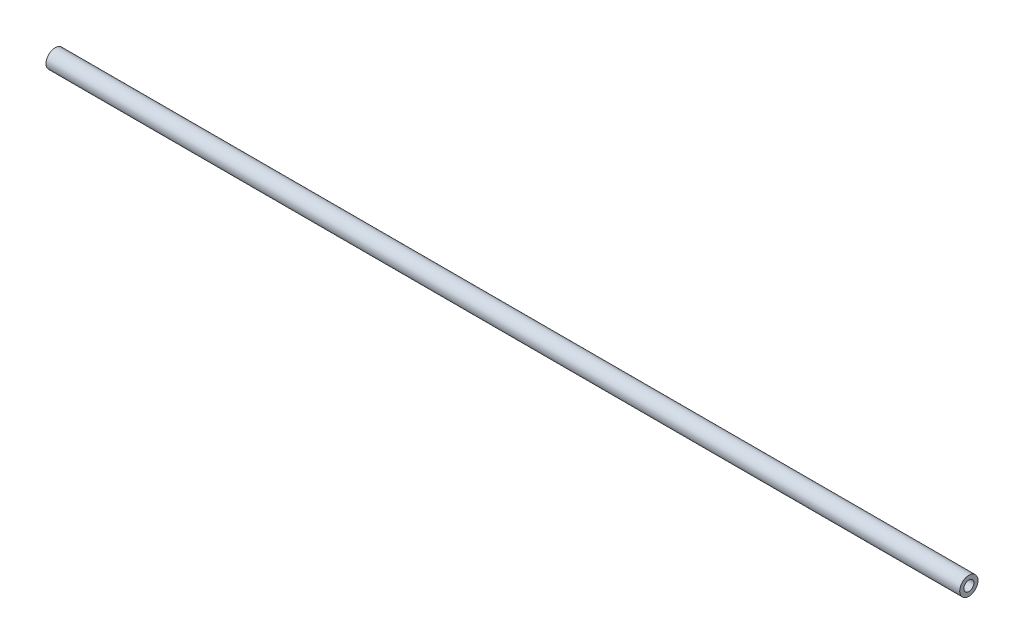
ISO-10303-21;
HEADER;
FILE_DESCRIPTION(('STEP AP214'),'2;1');
FILE_NAME('part.step','',(''),(''),'','','');
FILE_SCHEMA(('AUTOMOTIVE_DESIGN { 1 0 10303 214 1 1 1 1 }'));
ENDSEC;
DATA;
#1=APPLICATION_CONTEXT('core data for automotive mechanical design processes');
#2=APPLICATION_PROTOCOL_DEFINITION('international standard','automotive_design',2000,#1);
#3=PRODUCT_CONTEXT('',#1,'mechanical');
#4=PRODUCT('Part','Part','',(#3));
#5=PRODUCT_RELATED_PRODUCT_CATEGORY('part','',(#4));
#6=PRODUCT_DEFINITION_FORMATION('','',#4);
#7=PRODUCT_DEFINITION_CONTEXT('part definition',#1,'design');
#8=PRODUCT_DEFINITION('design','',#6,#7);
#9=PRODUCT_DEFINITION_SHAPE('','',#8);
#10=(LENGTH_UNIT() NAMED_UNIT(*) SI_UNIT(.MILLI.,.METRE.));
#11=(NAMED_UNIT(*) PLANE_ANGLE_UNIT() SI_UNIT($,.RADIAN.));
#12=(NAMED_UNIT(*) SI_UNIT($,.STERADIAN.) SOLID_ANGLE_UNIT());
#13=UNCERTAINTY_MEASURE_WITH_UNIT(LENGTH_MEASURE(1.E-05),#10,'distance_accuracy_value','');
#14=(GEOMETRIC_REPRESENTATION_CONTEXT(3) GLOBAL_UNCERTAINTY_ASSIGNED_CONTEXT((#13)) GLOBAL_UNIT_ASSIGNED_CONTEXT((#10,
#11,#12)) REPRESENTATION_CONTEXT('',''));
#15=CARTESIAN_POINT('',(0.,0.,0.));
#16=DIRECTION('',(0.,0.,1.));
#17=DIRECTION('',(1.,0.,0.));
#18=AXIS2_PLACEMENT_3D('',#15,#16,#17);
#19=CARTESIAN_POINT('',(300.,0.,0.));
#20=DIRECTION('',(-1.,0.,0.));
#21=DIRECTION('',(0.,0.,1.));
#22=AXIS2_PLACEMENT_3D('',#19,#20,#21);
#23=CYLINDRICAL_SURFACE('',#22,3.);
#24=CARTESIAN_POINT('',(300.,0.,0.));
#25=DIRECTION('',(1.,0.,0.));
#26=DIRECTION('',(0.,0.,-1.));
#27=AXIS2_PLACEMENT_3D('',#24,#25,#26);
#28=CIRCLE('',#27,3.);
#29=CARTESIAN_POINT('',(300.,0.,-3.));
#30=VERTEX_POINT('',#29);
#31=EDGE_CURVE('E11',#30,#30,#28,.T.);
#32=ORIENTED_EDGE('',*,*,#31,.F.);
#33=EDGE_LOOP('',(#32));
#34=FACE_BOUND('',#33,.T.);
#35=CARTESIAN_POINT('',(0.,0.,0.));
#36=DIRECTION('',(1.,0.,0.));
#37=DIRECTION('',(0.,0.,-1.));
#38=AXIS2_PLACEMENT_3D('',#35,#36,#37);
#39=CIRCLE('',#38,3.);
#40=CARTESIAN_POINT('',(0.,0.,-3.));
#41=VERTEX_POINT('',#40);
#42=EDGE_CURVE('E42',#41,#41,#39,.T.);
#43=ORIENTED_EDGE('',*,*,#42,.T.);
#44=EDGE_LOOP('',(#43));
#45=FACE_BOUND('',#44,.T.);
#46=ADVANCED_FACE('F39',(#34,#45),#23,.T.);
#47=CARTESIAN_POINT('',(300.,0.,0.));
#48=DIRECTION('',(1.,0.,0.));
#49=DIRECTION('',(0.,0.,-1.));
#50=AXIS2_PLACEMENT_3D('',#47,#48,#49);
#51=PLANE('',#50);
#52=CARTESIAN_POINT('',(300.,0.,0.));
#53=DIRECTION('',(1.,0.,0.));
#54=DIRECTION('',(0.,0.,-1.));
#55=AXIS2_PLACEMENT_3D('',#52,#53,#54);
#56=CIRCLE('',#55,1.64999999999999);
#57=CARTESIAN_POINT('',(300.,0.,-1.64999999999999));
#58=VERTEX_POINT('',#57);
#59=EDGE_CURVE('E62',#58,#58,#56,.T.);
#60=ORIENTED_EDGE('',*,*,#59,.F.);
#61=EDGE_LOOP('',(#60));
#62=FACE_BOUND('',#61,.T.);
#63=ORIENTED_EDGE('',*,*,#31,.T.);
#64=EDGE_LOOP('',(#63));
#65=FACE_BOUND('',#64,.T.);
#66=ADVANCED_FACE('F81',(#62,#65),#51,.T.);
#67=CARTESIAN_POINT('',(0.,0.,0.));
#68=DIRECTION('',(1.,0.,0.));
#69=DIRECTION('',(0.,0.,-1.));
#70=AXIS2_PLACEMENT_3D('',#67,#68,#69);
#71=PLANE('',#70);
#72=CARTESIAN_POINT('',(0.,0.,0.));
#73=DIRECTION('',(-1.,0.,0.));
#74=DIRECTION('',(0.,0.,1.));
#75=AXIS2_PLACEMENT_3D('',#72,#73,#74);
#76=CIRCLE('',#75,1.64999999999999);
#77=CARTESIAN_POINT('',(0.,0.,1.64999999999999));
#78=VERTEX_POINT('',#77);
#79=EDGE_CURVE('E63',#78,#78,#76,.T.);
#80=ORIENTED_EDGE('',*,*,#79,.F.);
#81=EDGE_LOOP('',(#80));
#82=FACE_BOUND('',#81,.T.);
#83=ORIENTED_EDGE('',*,*,#42,.F.);
#84=EDGE_LOOP('',(#83));
#85=FACE_BOUND('',#84,.T.);
#86=ADVANCED_FACE('F78',(#82,#85),#71,.F.);
#87=CARTESIAN_POINT('',(289.9,0.,0.));
#88=DIRECTION('',(1.,0.,0.));
#89=DIRECTION('',(0.,0.,-1.));
#90=AXIS2_PLACEMENT_3D('',#87,#88,#89);
#91=CONICAL_SURFACE('',#90,1.64999999999999,1.02974425867666);
#92=CARTESIAN_POINT('',(288.908579978605,0.,0.));
#93=VERTEX_POINT('',#92);
#94=VERTEX_LOOP('',#93);
#95=FACE_BOUND('',#94,.T.);
#96=CARTESIAN_POINT('',(289.9,0.,0.));
#97=DIRECTION('',(1.,0.,0.));
#98=DIRECTION('',(0.,0.,-1.));
#99=AXIS2_PLACEMENT_3D('',#96,#97,#98);
#100=CIRCLE('',#99,1.64999999999999);
#101=CARTESIAN_POINT('',(289.9,0.,-1.64999999999999));
#102=VERTEX_POINT('',#101);
#103=EDGE_CURVE('E66',#102,#102,#100,.T.);
#104=ORIENTED_EDGE('',*,*,#103,.T.);
#105=EDGE_LOOP('',(#104));
#106=FACE_BOUND('',#105,.T.);
#107=ADVANCED_FACE('F80',(#95,#106),#91,.F.);
#108=CARTESIAN_POINT('',(300.,0.,0.));
#109=DIRECTION('',(1.,0.,0.));
#110=DIRECTION('',(0.,0.,-1.));
#111=AXIS2_PLACEMENT_3D('',#108,#109,#110);
#112=CYLINDRICAL_SURFACE('',#111,1.64999999999999);
#113=ORIENTED_EDGE('',*,*,#103,.F.);
#114=EDGE_LOOP('',(#113));
#115=FACE_BOUND('',#114,.T.);
#116=ORIENTED_EDGE('',*,*,#59,.T.);
#117=EDGE_LOOP('',(#116));
#118=FACE_BOUND('',#117,.T.);
#119=ADVANCED_FACE('F56',(#115,#118),#112,.F.);
#120=CARTESIAN_POINT('',(10.1,0.,0.));
#121=DIRECTION('',(-1.,0.,0.));
#122=DIRECTION('',(0.,0.,1.));
#123=AXIS2_PLACEMENT_3D('',#120,#121,#122);
#124=CONICAL_SURFACE('',#123,1.64999999999999,1.02974425867665);
#125=CARTESIAN_POINT('',(11.0914200213955,0.,0.));
#126=VERTEX_POINT('',#125);
#127=VERTEX_LOOP('',#126);
#128=FACE_BOUND('',#127,.T.);
#129=CARTESIAN_POINT('',(10.1,0.,0.));
#130=DIRECTION('',(-1.,0.,0.));
#131=DIRECTION('',(0.,0.,1.));
#132=AXIS2_PLACEMENT_3D('',#129,#130,#131);
#133=CIRCLE('',#132,1.64999999999999);
#134=CARTESIAN_POINT('',(10.1,0.,1.64999999999999));
#135=VERTEX_POINT('',#134);
#136=EDGE_CURVE('E60',#135,#135,#133,.T.);
#137=ORIENTED_EDGE('',*,*,#136,.T.);
#138=EDGE_LOOP('',(#137));
#139=FACE_BOUND('',#138,.T.);
#140=ADVANCED_FACE('F52',(#128,#139),#124,.F.);
#141=CARTESIAN_POINT('',(0.,0.,0.));
#142=DIRECTION('',(-1.,0.,0.));
#143=DIRECTION('',(0.,0.,1.));
#144=AXIS2_PLACEMENT_3D('',#141,#142,#143);
#145=CYLINDRICAL_SURFACE('',#144,1.64999999999999);
#146=ORIENTED_EDGE('',*,*,#136,.F.);
#147=EDGE_LOOP('',(#146));
#148=FACE_BOUND('',#147,.T.);
#149=ORIENTED_EDGE('',*,*,#79,.T.);
#150=EDGE_LOOP('',(#149));
#151=FACE_BOUND('',#150,.T.);
#152=ADVANCED_FACE('F55',(#148,#151),#145,.F.);
#153=CLOSED_SHELL('',(#46,#66,#86,#107,#119,#140,#152));
#154=MANIFOLD_SOLID_BREP('B2',#153);
#155=ADVANCED_BREP_SHAPE_REPRESENTATION('',(#18,#154),#14);
#156=SHAPE_DEFINITION_REPRESENTATION(#9,#155);
ENDSEC;
END-ISO-10303-21;
